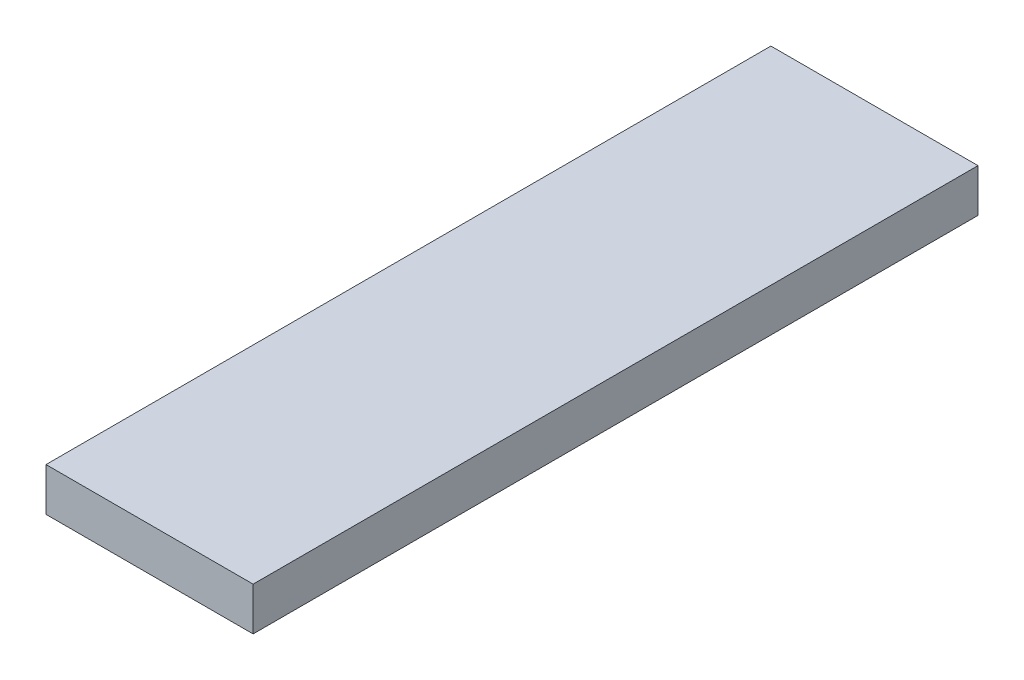
ISO-10303-21;
HEADER;
FILE_DESCRIPTION(('STEP AP214'),'2;1');
FILE_NAME('part.step','',(''),(''),'','','');
FILE_SCHEMA(('AUTOMOTIVE_DESIGN { 1 0 10303 214 1 1 1 1 }'));
ENDSEC;
DATA;
#1=APPLICATION_CONTEXT('core data for automotive mechanical design processes');
#2=APPLICATION_PROTOCOL_DEFINITION('international standard','automotive_design',2000,#1);
#3=PRODUCT_CONTEXT('',#1,'mechanical');
#4=PRODUCT('Part','Part','',(#3));
#5=PRODUCT_RELATED_PRODUCT_CATEGORY('part','',(#4));
#6=PRODUCT_DEFINITION_FORMATION('','',#4);
#7=PRODUCT_DEFINITION_CONTEXT('part definition',#1,'design');
#8=PRODUCT_DEFINITION('design','',#6,#7);
#9=PRODUCT_DEFINITION_SHAPE('','',#8);
#10=(LENGTH_UNIT() NAMED_UNIT(*) SI_UNIT(.MILLI.,.METRE.));
#11=(NAMED_UNIT(*) PLANE_ANGLE_UNIT() SI_UNIT($,.RADIAN.));
#12=(NAMED_UNIT(*) SI_UNIT($,.STERADIAN.) SOLID_ANGLE_UNIT());
#13=UNCERTAINTY_MEASURE_WITH_UNIT(LENGTH_MEASURE(1.E-05),#10,'distance_accuracy_value','');
#14=(GEOMETRIC_REPRESENTATION_CONTEXT(3) GLOBAL_UNCERTAINTY_ASSIGNED_CONTEXT((#13)) GLOBAL_UNIT_ASSIGNED_CONTEXT((#10,
#11,#12)) REPRESENTATION_CONTEXT('',''));
#15=CARTESIAN_POINT('',(0.,0.,0.));
#16=DIRECTION('',(0.,0.,1.));
#17=DIRECTION('',(1.,0.,0.));
#18=AXIS2_PLACEMENT_3D('',#15,#16,#17);
#19=CARTESIAN_POINT('',(0.,0.,53.34));
#20=DIRECTION('',(-1.,0.,0.));
#21=DIRECTION('',(0.,-1.,0.));
#22=AXIS2_PLACEMENT_3D('',#19,#20,#21);
#23=PLANE('',#22);
#24=DIRECTION('',(0.,1.,0.));
#25=VECTOR('',#24,1.);
#26=CARTESIAN_POINT('',(0.,0.,0.));
#27=LINE('',#26,#25);
#28=CARTESIAN_POINT('',(0.,0.,0.));
#29=VERTEX_POINT('',#28);
#30=CARTESIAN_POINT('',(0.,3.175,0.));
#31=VERTEX_POINT('',#30);
#32=EDGE_CURVE('E99',#29,#31,#27,.T.);
#33=ORIENTED_EDGE('',*,*,#32,.T.);
#34=DIRECTION('',(0.,0.,-1.));
#35=VECTOR('',#34,1.);
#36=CARTESIAN_POINT('',(0.,3.175,53.34));
#37=LINE('',#36,#35);
#38=CARTESIAN_POINT('',(0.,3.175,53.34));
#39=VERTEX_POINT('',#38);
#40=EDGE_CURVE('E11',#39,#31,#37,.T.);
#41=ORIENTED_EDGE('',*,*,#40,.F.);
#42=DIRECTION('',(0.,1.,0.));
#43=VECTOR('',#42,1.);
#44=CARTESIAN_POINT('',(0.,0.,53.34));
#45=LINE('',#44,#43);
#46=CARTESIAN_POINT('',(0.,0.,53.34));
#47=VERTEX_POINT('',#46);
#48=EDGE_CURVE('E87',#47,#39,#45,.T.);
#49=ORIENTED_EDGE('',*,*,#48,.F.);
#50=DIRECTION('',(0.,0.,-1.));
#51=VECTOR('',#50,1.);
#52=CARTESIAN_POINT('',(0.,0.,53.34));
#53=LINE('',#52,#51);
#54=EDGE_CURVE('E95',#47,#29,#53,.T.);
#55=ORIENTED_EDGE('',*,*,#54,.T.);
#56=EDGE_LOOP('',(#33,#41,#49,#55));
#57=FACE_BOUND('',#56,.T.);
#58=ADVANCED_FACE('F36',(#57),#23,.F.);
#59=CARTESIAN_POINT('',(0.,3.175,53.34));
#60=DIRECTION('',(0.,-1.,0.));
#61=DIRECTION('',(1.,0.,0.));
#62=AXIS2_PLACEMENT_3D('',#59,#60,#61);
#63=PLANE('',#62);
#64=DIRECTION('',(-1.,0.,0.));
#65=VECTOR('',#64,1.);
#66=CARTESIAN_POINT('',(0.,3.175,0.));
#67=LINE('',#66,#65);
#68=CARTESIAN_POINT('',(-15.24,3.175,0.));
#69=VERTEX_POINT('',#68);
#70=EDGE_CURVE('E91',#31,#69,#67,.T.);
#71=ORIENTED_EDGE('',*,*,#70,.T.);
#72=DIRECTION('',(0.,0.,-1.));
#73=VECTOR('',#72,1.);
#74=CARTESIAN_POINT('',(-15.24,3.175,53.34));
#75=LINE('',#74,#73);
#76=CARTESIAN_POINT('',(-15.24,3.175,53.34));
#77=VERTEX_POINT('',#76);
#78=EDGE_CURVE('E44',#77,#69,#75,.T.);
#79=ORIENTED_EDGE('',*,*,#78,.F.);
#80=DIRECTION('',(-1.,0.,0.));
#81=VECTOR('',#80,1.);
#82=CARTESIAN_POINT('',(0.,3.175,53.34));
#83=LINE('',#82,#81);
#84=EDGE_CURVE('E82',#39,#77,#83,.T.);
#85=ORIENTED_EDGE('',*,*,#84,.F.);
#86=ORIENTED_EDGE('',*,*,#40,.T.);
#87=EDGE_LOOP('',(#71,#79,#85,#86));
#88=FACE_BOUND('',#87,.T.);
#89=ADVANCED_FACE('F90',(#88),#63,.F.);
#90=CARTESIAN_POINT('',(-15.24,0.,53.34));
#91=DIRECTION('',(1.,0.,0.));
#92=DIRECTION('',(0.,0.,-1.));
#93=AXIS2_PLACEMENT_3D('',#90,#91,#92);
#94=PLANE('',#93);
#95=DIRECTION('',(0.,-1.,0.));
#96=VECTOR('',#95,1.);
#97=CARTESIAN_POINT('',(-15.24,0.,0.));
#98=LINE('',#97,#96);
#99=CARTESIAN_POINT('',(-15.24,0.,0.));
#100=VERTEX_POINT('',#99);
#101=EDGE_CURVE('E69',#69,#100,#98,.T.);
#102=ORIENTED_EDGE('',*,*,#101,.T.);
#103=DIRECTION('',(0.,0.,-1.));
#104=VECTOR('',#103,1.);
#105=CARTESIAN_POINT('',(-15.24,0.,53.34));
#106=LINE('',#105,#104);
#107=CARTESIAN_POINT('',(-15.24,0.,53.34));
#108=VERTEX_POINT('',#107);
#109=EDGE_CURVE('E92',#108,#100,#106,.T.);
#110=ORIENTED_EDGE('',*,*,#109,.F.);
#111=DIRECTION('',(0.,-1.,0.));
#112=VECTOR('',#111,1.);
#113=CARTESIAN_POINT('',(-15.24,0.,53.34));
#114=LINE('',#113,#112);
#115=EDGE_CURVE('E85',#77,#108,#114,.T.);
#116=ORIENTED_EDGE('',*,*,#115,.F.);
#117=ORIENTED_EDGE('',*,*,#78,.T.);
#118=EDGE_LOOP('',(#102,#110,#116,#117));
#119=FACE_BOUND('',#118,.T.);
#120=ADVANCED_FACE('F93',(#119),#94,.F.);
#121=CARTESIAN_POINT('',(0.,0.,53.34));
#122=DIRECTION('',(0.,1.,0.));
#123=DIRECTION('',(0.,0.,1.));
#124=AXIS2_PLACEMENT_3D('',#121,#122,#123);
#125=PLANE('',#124);
#126=DIRECTION('',(1.,0.,0.));
#127=VECTOR('',#126,1.);
#128=CARTESIAN_POINT('',(0.,0.,0.));
#129=LINE('',#128,#127);
#130=EDGE_CURVE('E75',#100,#29,#129,.T.);
#131=ORIENTED_EDGE('',*,*,#130,.T.);
#132=ORIENTED_EDGE('',*,*,#54,.F.);
#133=DIRECTION('',(1.,0.,0.));
#134=VECTOR('',#133,1.);
#135=CARTESIAN_POINT('',(0.,0.,53.34));
#136=LINE('',#135,#134);
#137=EDGE_CURVE('E52',#108,#47,#136,.T.);
#138=ORIENTED_EDGE('',*,*,#137,.F.);
#139=ORIENTED_EDGE('',*,*,#109,.T.);
#140=EDGE_LOOP('',(#131,#132,#138,#139));
#141=FACE_BOUND('',#140,.T.);
#142=ADVANCED_FACE('F106',(#141),#125,.F.);
#143=CARTESIAN_POINT('',(0.,0.,53.34));
#144=DIRECTION('',(0.,0.,1.));
#145=DIRECTION('',(1.,0.,0.));
#146=AXIS2_PLACEMENT_3D('',#143,#144,#145);
#147=PLANE('',#146);
#148=ORIENTED_EDGE('',*,*,#48,.T.);
#149=ORIENTED_EDGE('',*,*,#84,.T.);
#150=ORIENTED_EDGE('',*,*,#115,.T.);
#151=ORIENTED_EDGE('',*,*,#137,.T.);
#152=EDGE_LOOP('',(#148,#149,#150,#151));
#153=FACE_BOUND('',#152,.T.);
#154=ADVANCED_FACE('F83',(#153),#147,.T.);
#155=CARTESIAN_POINT('',(0.,0.,0.));
#156=DIRECTION('',(0.,0.,1.));
#157=DIRECTION('',(1.,0.,0.));
#158=AXIS2_PLACEMENT_3D('',#155,#156,#157);
#159=PLANE('',#158);
#160=ORIENTED_EDGE('',*,*,#32,.F.);
#161=ORIENTED_EDGE('',*,*,#130,.F.);
#162=ORIENTED_EDGE('',*,*,#101,.F.);
#163=ORIENTED_EDGE('',*,*,#70,.F.);
#164=EDGE_LOOP('',(#160,#161,#162,#163));
#165=FACE_BOUND('',#164,.T.);
#166=ADVANCED_FACE('F109',(#165),#159,.F.);
#167=CLOSED_SHELL('',(#58,#89,#120,#142,#154,#166));
#168=MANIFOLD_SOLID_BREP('B2',#167);
#169=ADVANCED_BREP_SHAPE_REPRESENTATION('',(#18,#168),#14);
#170=SHAPE_DEFINITION_REPRESENTATION(#9,#169);
ENDSEC;
END-ISO-10303-21;
